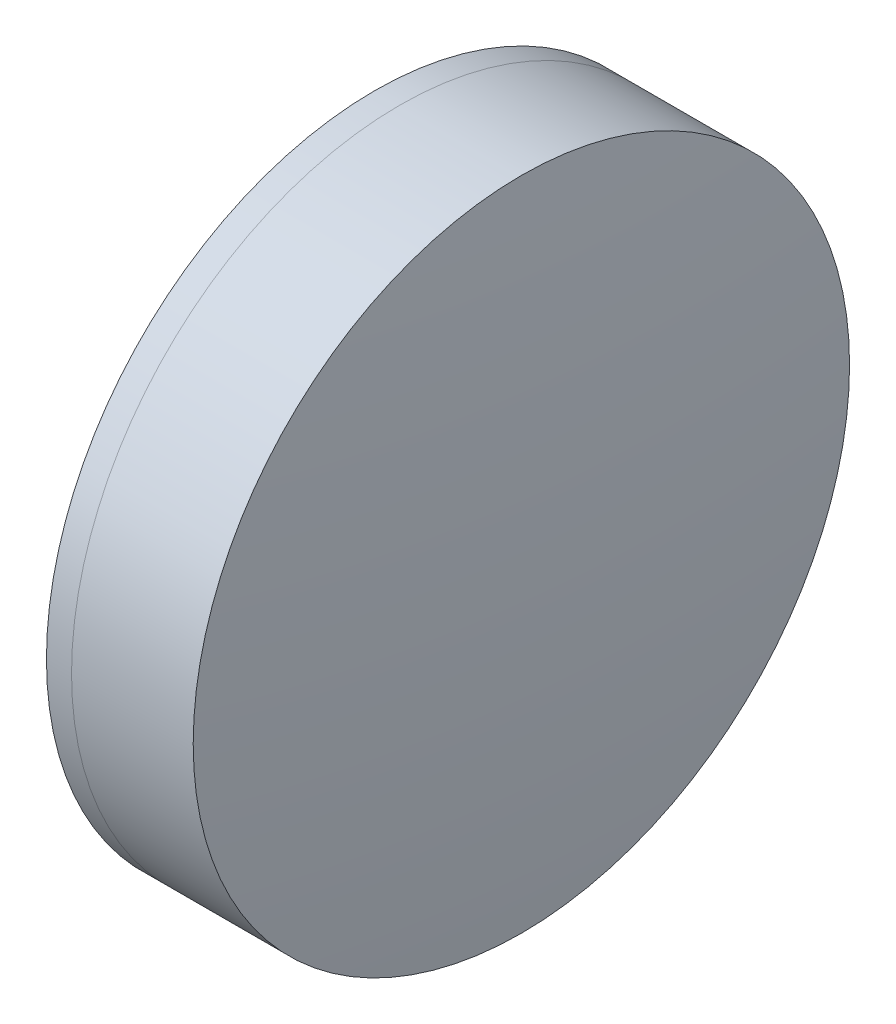
ISO-10303-21;
HEADER;
FILE_DESCRIPTION(('STEP AP214'),'2;1');
FILE_NAME('part.step','',(''),(''),'','','');
FILE_SCHEMA(('AUTOMOTIVE_DESIGN { 1 0 10303 214 1 1 1 1 }'));
ENDSEC;
DATA;
#1=APPLICATION_CONTEXT('core data for automotive mechanical design processes');
#2=APPLICATION_PROTOCOL_DEFINITION('international standard','automotive_design',2000,#1);
#3=PRODUCT_CONTEXT('',#1,'mechanical');
#4=PRODUCT('Part','Part','',(#3));
#5=PRODUCT_RELATED_PRODUCT_CATEGORY('part','',(#4));
#6=PRODUCT_DEFINITION_FORMATION('','',#4);
#7=PRODUCT_DEFINITION_CONTEXT('part definition',#1,'design');
#8=PRODUCT_DEFINITION('design','',#6,#7);
#9=PRODUCT_DEFINITION_SHAPE('','',#8);
#10=(LENGTH_UNIT() NAMED_UNIT(*) SI_UNIT(.MILLI.,.METRE.));
#11=(NAMED_UNIT(*) PLANE_ANGLE_UNIT() SI_UNIT($,.RADIAN.));
#12=(NAMED_UNIT(*) SI_UNIT($,.STERADIAN.) SOLID_ANGLE_UNIT());
#13=UNCERTAINTY_MEASURE_WITH_UNIT(LENGTH_MEASURE(1.E-05),#10,'distance_accuracy_value','');
#14=(GEOMETRIC_REPRESENTATION_CONTEXT(3) GLOBAL_UNCERTAINTY_ASSIGNED_CONTEXT((#13)) GLOBAL_UNIT_ASSIGNED_CONTEXT((#10,
#11,#12)) REPRESENTATION_CONTEXT('',''));
#15=CARTESIAN_POINT('',(0.,0.,0.));
#16=DIRECTION('',(0.,0.,1.));
#17=DIRECTION('',(1.,0.,0.));
#18=AXIS2_PLACEMENT_3D('',#15,#16,#17);
#19=CARTESIAN_POINT('',(211.095845808419,0.,0.));
#20=DIRECTION('',(-1.,0.,0.));
#21=DIRECTION('',(0.,0.,1.));
#22=AXIS2_PLACEMENT_3D('',#19,#20,#21);
#23=SPHERICAL_SURFACE('',#22,25.9);
#24=CARTESIAN_POINT('',(233.668395509328,0.,0.));
#25=DIRECTION('',(-1.,0.,0.));
#26=DIRECTION('',(0.,0.,1.));
#27=AXIS2_PLACEMENT_3D('',#24,#25,#26);
#28=CIRCLE('',#27,12.7);
#29=CARTESIAN_POINT('',(233.668395509328,0.,12.7));
#30=VERTEX_POINT('',#29);
#31=EDGE_CURVE('E11',#30,#30,#28,.T.);
#32=ORIENTED_EDGE('',*,*,#31,.T.);
#33=EDGE_LOOP('',(#32));
#34=FACE_BOUND('',#33,.T.);
#35=ADVANCED_FACE('F45',(#34),#23,.F.);
#36=CARTESIAN_POINT('',(-0.551919992657797,0.,0.));
#37=DIRECTION('',(-1.,0.,0.));
#38=DIRECTION('',(0.,0.,1.));
#39=AXIS2_PLACEMENT_3D('',#36,#37,#38);
#40=CYLINDRICAL_SURFACE('',#39,12.7);
#41=CARTESIAN_POINT('',(238.37688288691,0.,0.));
#42=DIRECTION('',(-1.,0.,0.));
#43=DIRECTION('',(0.,0.,1.));
#44=AXIS2_PLACEMENT_3D('',#41,#42,#43);
#45=CIRCLE('',#44,12.7);
#46=CARTESIAN_POINT('',(238.37688288691,0.,12.7));
#47=VERTEX_POINT('',#46);
#48=EDGE_CURVE('E51',#47,#47,#45,.T.);
#49=ORIENTED_EDGE('',*,*,#48,.T.);
#50=EDGE_LOOP('',(#49));
#51=FACE_BOUND('',#50,.T.);
#52=ORIENTED_EDGE('',*,*,#31,.F.);
#53=EDGE_LOOP('',(#52));
#54=FACE_BOUND('',#53,.T.);
#55=ADVANCED_FACE('F57',(#51,#54),#40,.T.);
#56=CARTESIAN_POINT('',(108.395845808419,0.,0.));
#57=DIRECTION('',(-1.,0.,0.));
#58=DIRECTION('',(0.,0.,1.));
#59=AXIS2_PLACEMENT_3D('',#56,#57,#58);
#60=SPHERICAL_SURFACE('',#59,130.6);
#61=ORIENTED_EDGE('',*,*,#48,.F.);
#62=EDGE_LOOP('',(#61));
#63=FACE_BOUND('',#62,.T.);
#64=ADVANCED_FACE('F60',(#63),#60,.T.);
#65=CLOSED_SHELL('',(#35,#55,#64));
#66=MANIFOLD_SOLID_BREP('B2',#65);
#67=CARTESIAN_POINT('',(261.195845808419,0.,0.));
#68=DIRECTION('',(-1.,0.,0.));
#69=DIRECTION('',(0.,0.,1.));
#70=AXIS2_PLACEMENT_3D('',#67,#68,#69);
#71=SPHERICAL_SURFACE('',#70,31.2);
#72=CARTESIAN_POINT('',(232.697600248385,0.,0.));
#73=DIRECTION('',(-1.,0.,0.));
#74=DIRECTION('',(0.,0.,1.));
#75=AXIS2_PLACEMENT_3D('',#72,#73,#74);
#76=CIRCLE('',#75,12.7);
#77=CARTESIAN_POINT('',(232.697600248385,0.,12.7));
#78=VERTEX_POINT('',#77);
#79=EDGE_CURVE('E44',#78,#78,#76,.T.);
#80=ORIENTED_EDGE('',*,*,#79,.T.);
#81=EDGE_LOOP('',(#80));
#82=FACE_BOUND('',#81,.T.);
#83=ADVANCED_FACE('F86',(#82),#71,.T.);
#84=CARTESIAN_POINT('',(-9.70261217833668,0.,0.));
#85=DIRECTION('',(-1.,0.,0.));
#86=DIRECTION('',(0.,0.,1.));
#87=AXIS2_PLACEMENT_3D('',#84,#85,#86);
#88=CYLINDRICAL_SURFACE('',#87,12.7);
#89=CARTESIAN_POINT('',(233.668395509328,0.,0.));
#90=DIRECTION('',(-1.,0.,0.));
#91=DIRECTION('',(0.,0.,1.));
#92=AXIS2_PLACEMENT_3D('',#89,#90,#91);
#93=CIRCLE('',#92,12.7);
#94=CARTESIAN_POINT('',(233.668395509328,0.,12.7));
#95=VERTEX_POINT('',#94);
#96=EDGE_CURVE('E92',#95,#95,#93,.T.);
#97=ORIENTED_EDGE('',*,*,#96,.T.);
#98=EDGE_LOOP('',(#97));
#99=FACE_BOUND('',#98,.T.);
#100=ORIENTED_EDGE('',*,*,#79,.F.);
#101=EDGE_LOOP('',(#100));
#102=FACE_BOUND('',#101,.T.);
#103=ADVANCED_FACE('F98',(#99,#102),#88,.T.);
#104=CARTESIAN_POINT('',(211.095845808419,0.,0.));
#105=DIRECTION('',(-1.,0.,0.));
#106=DIRECTION('',(0.,0.,1.));
#107=AXIS2_PLACEMENT_3D('',#104,#105,#106);
#108=SPHERICAL_SURFACE('',#107,25.9);
#109=ORIENTED_EDGE('',*,*,#96,.F.);
#110=EDGE_LOOP('',(#109));
#111=FACE_BOUND('',#110,.T.);
#112=ADVANCED_FACE('F101',(#111),#108,.T.);
#113=CLOSED_SHELL('',(#83,#103,#112));
#114=MANIFOLD_SOLID_BREP('B6',#113);
#115=ADVANCED_BREP_SHAPE_REPRESENTATION('',(#18,#66,#114),#14);
#116=SHAPE_DEFINITION_REPRESENTATION(#9,#115);
ENDSEC;
END-ISO-10303-21;
